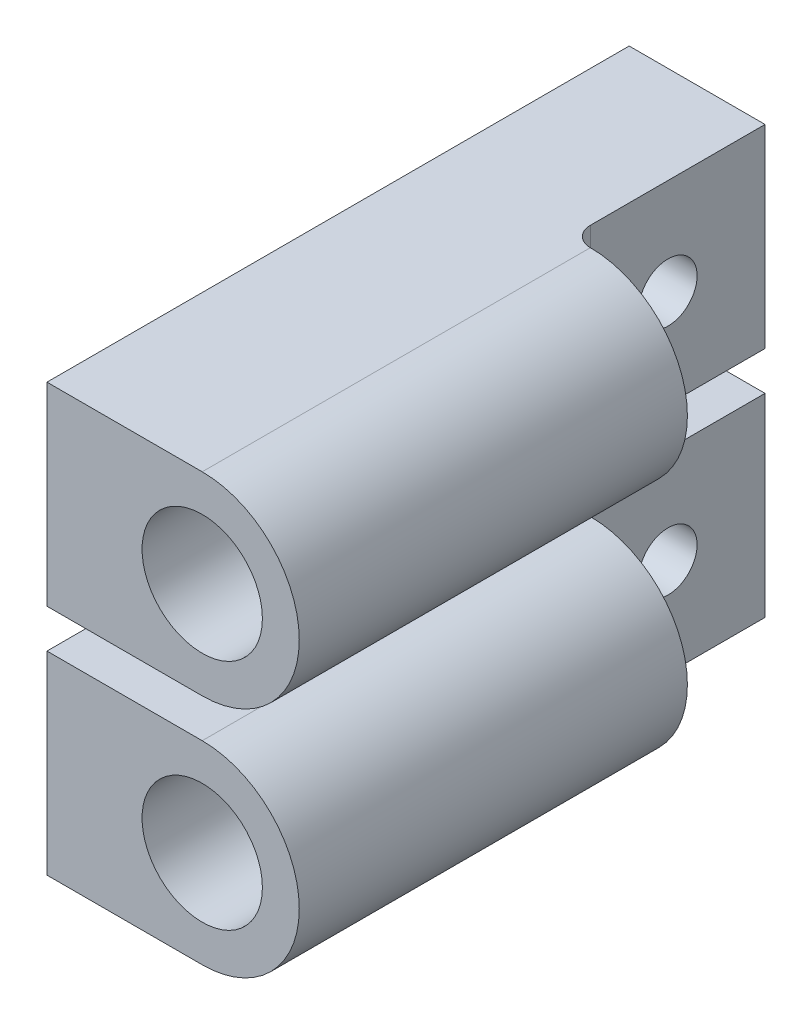
ISO-10303-21;
HEADER;
FILE_DESCRIPTION(('STEP AP214'),'2;1');
FILE_NAME('part.step','',(''),(''),'','','');
FILE_SCHEMA(('AUTOMOTIVE_DESIGN { 1 0 10303 214 1 1 1 1 }'));
ENDSEC;
DATA;
#1=APPLICATION_CONTEXT('core data for automotive mechanical design processes');
#2=APPLICATION_PROTOCOL_DEFINITION('international standard','automotive_design',2000,#1);
#3=PRODUCT_CONTEXT('',#1,'mechanical');
#4=PRODUCT('Part','Part','',(#3));
#5=PRODUCT_RELATED_PRODUCT_CATEGORY('part','',(#4));
#6=PRODUCT_DEFINITION_FORMATION('','',#4);
#7=PRODUCT_DEFINITION_CONTEXT('part definition',#1,'design');
#8=PRODUCT_DEFINITION('design','',#6,#7);
#9=PRODUCT_DEFINITION_SHAPE('','',#8);
#10=(LENGTH_UNIT() NAMED_UNIT(*) SI_UNIT(.MILLI.,.METRE.));
#11=(NAMED_UNIT(*) PLANE_ANGLE_UNIT() SI_UNIT($,.RADIAN.));
#12=(NAMED_UNIT(*) SI_UNIT($,.STERADIAN.) SOLID_ANGLE_UNIT());
#13=UNCERTAINTY_MEASURE_WITH_UNIT(LENGTH_MEASURE(1.E-05),#10,'distance_accuracy_value','');
#14=(GEOMETRIC_REPRESENTATION_CONTEXT(3) GLOBAL_UNCERTAINTY_ASSIGNED_CONTEXT((#13)) GLOBAL_UNIT_ASSIGNED_CONTEXT((#10,
#11,#12)) REPRESENTATION_CONTEXT('',''));
#15=CARTESIAN_POINT('',(0.,0.,0.));
#16=DIRECTION('',(0.,0.,1.));
#17=DIRECTION('',(1.,0.,0.));
#18=AXIS2_PLACEMENT_3D('',#15,#16,#17);
#19=CARTESIAN_POINT('',(-8.,17.,30.));
#20=DIRECTION('',(0.,-1.,0.));
#21=DIRECTION('',(0.,0.,-1.));
#22=AXIS2_PLACEMENT_3D('',#19,#20,#21);
#23=PLANE('',#22);
#24=DIRECTION('',(0.,0.,-1.));
#25=VECTOR('',#24,1.);
#26=CARTESIAN_POINT('',(0.,17.,30.));
#27=LINE('',#26,#25);
#28=CARTESIAN_POINT('',(0.,17.,30.));
#29=VERTEX_POINT('',#28);
#30=CARTESIAN_POINT('',(0.,17.,10.));
#31=VERTEX_POINT('',#30);
#32=EDGE_CURVE('E126',#29,#31,#27,.T.);
#33=ORIENTED_EDGE('',*,*,#32,.T.);
#34=CARTESIAN_POINT('',(0.,17.,9.));
#35=DIRECTION('',(0.,-1.,0.));
#36=DIRECTION('',(0.,0.,-1.));
#37=AXIS2_PLACEMENT_3D('',#34,#35,#36);
#38=CIRCLE('',#37,1.);
#39=CARTESIAN_POINT('',(-0.999999999999998,17.,9.));
#40=VERTEX_POINT('',#39);
#41=EDGE_CURVE('E12',#31,#40,#38,.T.);
#42=ORIENTED_EDGE('',*,*,#41,.T.);
#43=DIRECTION('',(0.,0.,1.));
#44=VECTOR('',#43,1.);
#45=CARTESIAN_POINT('',(-0.999999999999998,17.,10.));
#46=LINE('',#45,#44);
#47=CARTESIAN_POINT('',(-0.999999999999998,17.,0.));
#48=VERTEX_POINT('',#47);
#49=EDGE_CURVE('E98',#48,#40,#46,.T.);
#50=ORIENTED_EDGE('',*,*,#49,.F.);
#51=DIRECTION('',(-1.,0.,0.));
#52=VECTOR('',#51,1.);
#53=CARTESIAN_POINT('',(-8.,17.,0.));
#54=LINE('',#53,#52);
#55=CARTESIAN_POINT('',(-8.,17.,0.));
#56=VERTEX_POINT('',#55);
#57=EDGE_CURVE('E107',#48,#56,#54,.T.);
#58=ORIENTED_EDGE('',*,*,#57,.T.);
#59=DIRECTION('',(0.,0.,-1.));
#60=VECTOR('',#59,1.);
#61=CARTESIAN_POINT('',(-8.,17.,30.));
#62=LINE('',#61,#60);
#63=CARTESIAN_POINT('',(-8.,17.,30.));
#64=VERTEX_POINT('',#63);
#65=EDGE_CURVE('E134',#64,#56,#62,.T.);
#66=ORIENTED_EDGE('',*,*,#65,.F.);
#67=DIRECTION('',(-1.,0.,0.));
#68=VECTOR('',#67,1.);
#69=CARTESIAN_POINT('',(-8.,17.,30.));
#70=LINE('',#69,#68);
#71=EDGE_CURVE('E125',#29,#64,#70,.T.);
#72=ORIENTED_EDGE('',*,*,#71,.F.);
#73=EDGE_LOOP('',(#33,#42,#50,#58,#66,#72));
#74=FACE_BOUND('',#73,.T.);
#75=ADVANCED_FACE('F44',(#74),#23,.F.);
#76=CARTESIAN_POINT('',(-8.,7.,30.));
#77=DIRECTION('',(0.,1.,0.));
#78=DIRECTION('',(0.,0.,1.));
#79=AXIS2_PLACEMENT_3D('',#76,#77,#78);
#80=PLANE('',#79);
#81=DIRECTION('',(0.,0.,-1.));
#82=VECTOR('',#81,1.);
#83=CARTESIAN_POINT('',(-1.,7.,10.));
#84=LINE('',#83,#82);
#85=CARTESIAN_POINT('',(-1.,7.,9.));
#86=VERTEX_POINT('',#85);
#87=CARTESIAN_POINT('',(-0.999999999999999,7.,0.));
#88=VERTEX_POINT('',#87);
#89=EDGE_CURVE('E100',#86,#88,#84,.T.);
#90=ORIENTED_EDGE('',*,*,#89,.F.);
#91=CARTESIAN_POINT('',(0.,7.,9.));
#92=DIRECTION('',(0.,1.,0.));
#93=DIRECTION('',(0.,0.,1.));
#94=AXIS2_PLACEMENT_3D('',#91,#92,#93);
#95=CIRCLE('',#94,1.);
#96=CARTESIAN_POINT('',(0.,7.,10.));
#97=VERTEX_POINT('',#96);
#98=EDGE_CURVE('E52',#86,#97,#95,.T.);
#99=ORIENTED_EDGE('',*,*,#98,.T.);
#100=DIRECTION('',(0.,0.,-1.));
#101=VECTOR('',#100,1.);
#102=CARTESIAN_POINT('',(0.,7.,30.));
#103=LINE('',#102,#101);
#104=CARTESIAN_POINT('',(0.,7.,30.));
#105=VERTEX_POINT('',#104);
#106=EDGE_CURVE('E128',#105,#97,#103,.T.);
#107=ORIENTED_EDGE('',*,*,#106,.F.);
#108=DIRECTION('',(1.,0.,0.));
#109=VECTOR('',#108,1.);
#110=CARTESIAN_POINT('',(-8.,7.,30.));
#111=LINE('',#110,#109);
#112=CARTESIAN_POINT('',(-8.,7.,30.));
#113=VERTEX_POINT('',#112);
#114=EDGE_CURVE('E207',#113,#105,#111,.T.);
#115=ORIENTED_EDGE('',*,*,#114,.F.);
#116=DIRECTION('',(0.,0.,-1.));
#117=VECTOR('',#116,1.);
#118=CARTESIAN_POINT('',(-8.,7.,30.));
#119=LINE('',#118,#117);
#120=CARTESIAN_POINT('',(-8.,7.,0.));
#121=VERTEX_POINT('',#120);
#122=EDGE_CURVE('E131',#113,#121,#119,.T.);
#123=ORIENTED_EDGE('',*,*,#122,.T.);
#124=DIRECTION('',(1.,0.,0.));
#125=VECTOR('',#124,1.);
#126=CARTESIAN_POINT('',(-8.,7.,0.));
#127=LINE('',#126,#125);
#128=EDGE_CURVE('E116',#121,#88,#127,.T.);
#129=ORIENTED_EDGE('',*,*,#128,.T.);
#130=EDGE_LOOP('',(#90,#99,#107,#115,#123,#129));
#131=FACE_BOUND('',#130,.T.);
#132=ADVANCED_FACE('F144',(#131),#80,.F.);
#133=CARTESIAN_POINT('',(0.,12.,30.));
#134=DIRECTION('',(0.,0.,-1.));
#135=DIRECTION('',(-1.,0.,0.));
#136=AXIS2_PLACEMENT_3D('',#133,#134,#135);
#137=CYLINDRICAL_SURFACE('',#136,5.);
#138=CARTESIAN_POINT('',(0.,12.,10.));
#139=DIRECTION('',(0.,0.,-1.));
#140=DIRECTION('',(0.,1.,0.));
#141=AXIS2_PLACEMENT_3D('',#138,#139,#140);
#142=CIRCLE('',#141,5.);
#143=EDGE_CURVE('E136',#31,#97,#142,.T.);
#144=ORIENTED_EDGE('',*,*,#143,.F.);
#145=ORIENTED_EDGE('',*,*,#32,.F.);
#146=CARTESIAN_POINT('',(0.,12.,30.));
#147=DIRECTION('',(0.,0.,1.));
#148=DIRECTION('',(1.,0.,0.));
#149=AXIS2_PLACEMENT_3D('',#146,#147,#148);
#150=CIRCLE('',#149,5.);
#151=EDGE_CURVE('E121',#105,#29,#150,.T.);
#152=ORIENTED_EDGE('',*,*,#151,.F.);
#153=ORIENTED_EDGE('',*,*,#106,.T.);
#154=EDGE_LOOP('',(#144,#145,#152,#153));
#155=FACE_BOUND('',#154,.T.);
#156=ADVANCED_FACE('F152',(#155),#137,.T.);
#157=CARTESIAN_POINT('',(0.,12.,0.));
#158=DIRECTION('',(0.,0.,1.));
#159=DIRECTION('',(1.,0.,0.));
#160=AXIS2_PLACEMENT_3D('',#157,#158,#159);
#161=PLANE('',#160);
#162=DIRECTION('',(0.,1.,0.));
#163=VECTOR('',#162,1.);
#164=CARTESIAN_POINT('',(-0.999999999999998,17.,0.));
#165=LINE('',#164,#163);
#166=EDGE_CURVE('E96',#88,#48,#165,.T.);
#167=ORIENTED_EDGE('',*,*,#166,.F.);
#168=ORIENTED_EDGE('',*,*,#128,.F.);
#169=DIRECTION('',(0.,-1.,0.));
#170=VECTOR('',#169,1.);
#171=CARTESIAN_POINT('',(-8.,17.,0.));
#172=LINE('',#171,#170);
#173=EDGE_CURVE('E112',#56,#121,#172,.T.);
#174=ORIENTED_EDGE('',*,*,#173,.F.);
#175=ORIENTED_EDGE('',*,*,#57,.F.);
#176=EDGE_LOOP('',(#167,#168,#174,#175));
#177=FACE_BOUND('',#176,.T.);
#178=ADVANCED_FACE('F111',(#177),#161,.F.);
#179=CARTESIAN_POINT('',(-8.,17.,30.));
#180=DIRECTION('',(1.,0.,0.));
#181=DIRECTION('',(0.,1.,0.));
#182=AXIS2_PLACEMENT_3D('',#179,#180,#181);
#183=PLANE('',#182);
#184=CARTESIAN_POINT('',(-8.,12.,5.));
#185=DIRECTION('',(1.,0.,0.));
#186=DIRECTION('',(0.,0.,-1.));
#187=AXIS2_PLACEMENT_3D('',#184,#185,#186);
#188=CIRCLE('',#187,1.5);
#189=CARTESIAN_POINT('',(-8.,12.,3.5));
#190=VERTEX_POINT('',#189);
#191=EDGE_CURVE('E196',#190,#190,#188,.T.);
#192=ORIENTED_EDGE('',*,*,#191,.T.);
#193=EDGE_LOOP('',(#192));
#194=FACE_BOUND('',#193,.T.);
#195=ORIENTED_EDGE('',*,*,#173,.T.);
#196=ORIENTED_EDGE('',*,*,#122,.F.);
#197=DIRECTION('',(0.,-1.,0.));
#198=VECTOR('',#197,1.);
#199=CARTESIAN_POINT('',(-8.,17.,30.));
#200=LINE('',#199,#198);
#201=EDGE_CURVE('E206',#64,#113,#200,.T.);
#202=ORIENTED_EDGE('',*,*,#201,.F.);
#203=ORIENTED_EDGE('',*,*,#65,.T.);
#204=EDGE_LOOP('',(#195,#196,#202,#203));
#205=FACE_BOUND('',#204,.T.);
#206=ADVANCED_FACE('F166',(#194,#205),#183,.F.);
#207=CARTESIAN_POINT('',(0.,12.,30.));
#208=DIRECTION('',(0.,0.,1.));
#209=DIRECTION('',(1.,0.,0.));
#210=AXIS2_PLACEMENT_3D('',#207,#208,#209);
#211=PLANE('',#210);
#212=CARTESIAN_POINT('',(0.,12.,30.));
#213=DIRECTION('',(0.,0.,1.));
#214=DIRECTION('',(1.,0.,0.));
#215=AXIS2_PLACEMENT_3D('',#212,#213,#214);
#216=CIRCLE('',#215,3.1);
#217=CARTESIAN_POINT('',(3.1,12.,30.));
#218=VERTEX_POINT('',#217);
#219=EDGE_CURVE('E109',#218,#218,#216,.T.);
#220=ORIENTED_EDGE('',*,*,#219,.F.);
#221=EDGE_LOOP('',(#220));
#222=FACE_BOUND('',#221,.T.);
#223=ORIENTED_EDGE('',*,*,#71,.T.);
#224=ORIENTED_EDGE('',*,*,#201,.T.);
#225=ORIENTED_EDGE('',*,*,#114,.T.);
#226=ORIENTED_EDGE('',*,*,#151,.T.);
#227=EDGE_LOOP('',(#223,#224,#225,#226));
#228=FACE_BOUND('',#227,.T.);
#229=ADVANCED_FACE('F168',(#222,#228),#211,.T.);
#230=CARTESIAN_POINT('',(0.,12.,14.));
#231=DIRECTION('',(0.,0.,1.));
#232=DIRECTION('',(1.,0.,0.));
#233=AXIS2_PLACEMENT_3D('',#230,#231,#232);
#234=CYLINDRICAL_SURFACE('',#233,3.1);
#235=CARTESIAN_POINT('',(0.,12.,14.));
#236=DIRECTION('',(0.,0.,1.));
#237=DIRECTION('',(1.,0.,0.));
#238=AXIS2_PLACEMENT_3D('',#235,#236,#237);
#239=CIRCLE('',#238,3.1);
#240=CARTESIAN_POINT('',(3.1,12.,14.));
#241=VERTEX_POINT('',#240);
#242=EDGE_CURVE('E114',#241,#241,#239,.T.);
#243=ORIENTED_EDGE('',*,*,#242,.F.);
#244=EDGE_LOOP('',(#243));
#245=FACE_BOUND('',#244,.T.);
#246=ORIENTED_EDGE('',*,*,#219,.T.);
#247=EDGE_LOOP('',(#246));
#248=FACE_BOUND('',#247,.T.);
#249=ADVANCED_FACE('F177',(#245,#248),#234,.F.);
#250=CARTESIAN_POINT('',(0.,12.,14.));
#251=DIRECTION('',(0.,0.,1.));
#252=DIRECTION('',(1.,0.,0.));
#253=AXIS2_PLACEMENT_3D('',#250,#251,#252);
#254=PLANE('',#253);
#255=ORIENTED_EDGE('',*,*,#242,.T.);
#256=EDGE_LOOP('',(#255));
#257=FACE_BOUND('',#256,.T.);
#258=ADVANCED_FACE('F181',(#257),#254,.T.);
#259=CARTESIAN_POINT('',(5.,17.,10.));
#260=DIRECTION('',(0.,0.,-1.));
#261=DIRECTION('',(0.,1.,0.));
#262=AXIS2_PLACEMENT_3D('',#259,#260,#261);
#263=PLANE('',#262);
#264=ORIENTED_EDGE('',*,*,#143,.T.);
#265=DIRECTION('',(0.,-1.,0.));
#266=VECTOR('',#265,1.);
#267=CARTESIAN_POINT('',(0.,17.,10.));
#268=LINE('',#267,#266);
#269=EDGE_CURVE('E141',#97,#31,#268,.F.);
#270=ORIENTED_EDGE('',*,*,#269,.T.);
#271=EDGE_LOOP('',(#264,#270));
#272=FACE_BOUND('',#271,.T.);
#273=ADVANCED_FACE('F149',(#272),#263,.T.);
#274=CARTESIAN_POINT('',(-0.999999999999999,12.,0.));
#275=DIRECTION('',(1.,0.,0.));
#276=DIRECTION('',(0.,1.,0.));
#277=AXIS2_PLACEMENT_3D('',#274,#275,#276);
#278=PLANE('',#277);
#279=CARTESIAN_POINT('',(-0.999999999999999,12.,5.));
#280=DIRECTION('',(1.,0.,0.));
#281=DIRECTION('',(0.,0.,-1.));
#282=AXIS2_PLACEMENT_3D('',#279,#280,#281);
#283=CIRCLE('',#282,1.5);
#284=CARTESIAN_POINT('',(-0.999999999999999,12.,3.5));
#285=VERTEX_POINT('',#284);
#286=EDGE_CURVE('E194',#285,#285,#283,.T.);
#287=ORIENTED_EDGE('',*,*,#286,.F.);
#288=EDGE_LOOP('',(#287));
#289=FACE_BOUND('',#288,.T.);
#290=ORIENTED_EDGE('',*,*,#49,.T.);
#291=DIRECTION('',(0.,-1.,0.));
#292=VECTOR('',#291,1.);
#293=CARTESIAN_POINT('',(-1.,7.,9.));
#294=LINE('',#293,#292);
#295=EDGE_CURVE('E139',#40,#86,#294,.T.);
#296=ORIENTED_EDGE('',*,*,#295,.T.);
#297=ORIENTED_EDGE('',*,*,#89,.T.);
#298=ORIENTED_EDGE('',*,*,#166,.T.);
#299=EDGE_LOOP('',(#290,#296,#297,#298));
#300=FACE_BOUND('',#299,.T.);
#301=ADVANCED_FACE('F97',(#289,#300),#278,.T.);
#302=CARTESIAN_POINT('',(-8.,12.,5.));
#303=DIRECTION('',(1.,0.,0.));
#304=DIRECTION('',(0.,0.,-1.));
#305=AXIS2_PLACEMENT_3D('',#302,#303,#304);
#306=CYLINDRICAL_SURFACE('',#305,1.5);
#307=ORIENTED_EDGE('',*,*,#191,.F.);
#308=EDGE_LOOP('',(#307));
#309=FACE_BOUND('',#308,.T.);
#310=ORIENTED_EDGE('',*,*,#286,.T.);
#311=EDGE_LOOP('',(#310));
#312=FACE_BOUND('',#311,.T.);
#313=ADVANCED_FACE('F154',(#309,#312),#306,.F.);
#314=CARTESIAN_POINT('',(0.,12.,9.));
#315=DIRECTION('',(0.,1.,0.));
#316=DIRECTION('',(0.,0.,1.));
#317=AXIS2_PLACEMENT_3D('',#314,#315,#316);
#318=CYLINDRICAL_SURFACE('',#317,1.);
#319=ORIENTED_EDGE('',*,*,#41,.F.);
#320=ORIENTED_EDGE('',*,*,#269,.F.);
#321=ORIENTED_EDGE('',*,*,#98,.F.);
#322=ORIENTED_EDGE('',*,*,#295,.F.);
#323=EDGE_LOOP('',(#319,#320,#321,#322));
#324=FACE_BOUND('',#323,.T.);
#325=ADVANCED_FACE('F46',(#324),#318,.F.);
#326=CLOSED_SHELL('',(#75,#132,#156,#178,#206,#229,#249,#258,#273,#301,#313,#325));
#327=MANIFOLD_SOLID_BREP('B2',#326);
#328=CARTESIAN_POINT('',(-8.,5.,30.));
#329=DIRECTION('',(0.,-1.,0.));
#330=DIRECTION('',(0.,0.,-1.));
#331=AXIS2_PLACEMENT_3D('',#328,#329,#330);
#332=PLANE('',#331);
#333=DIRECTION('',(0.,0.,-1.));
#334=VECTOR('',#333,1.);
#335=CARTESIAN_POINT('',(0.,5.,30.));
#336=LINE('',#335,#334);
#337=CARTESIAN_POINT('',(0.,5.,30.));
#338=VERTEX_POINT('',#337);
#339=CARTESIAN_POINT('',(0.,5.,10.));
#340=VERTEX_POINT('',#339);
#341=EDGE_CURVE('E366',#338,#340,#336,.T.);
#342=ORIENTED_EDGE('',*,*,#341,.T.);
#343=CARTESIAN_POINT('',(0.,5.,9.));
#344=DIRECTION('',(0.,-1.,0.));
#345=DIRECTION('',(0.,0.,-1.));
#346=AXIS2_PLACEMENT_3D('',#343,#344,#345);
#347=CIRCLE('',#346,1.);
#348=CARTESIAN_POINT('',(-1.,5.,9.));
#349=VERTEX_POINT('',#348);
#350=EDGE_CURVE('E42',#340,#349,#347,.T.);
#351=ORIENTED_EDGE('',*,*,#350,.T.);
#352=DIRECTION('',(0.,0.,1.));
#353=VECTOR('',#352,1.);
#354=CARTESIAN_POINT('',(-1.,5.,10.));
#355=LINE('',#354,#353);
#356=CARTESIAN_POINT('',(-1.,5.,0.));
#357=VERTEX_POINT('',#356);
#358=EDGE_CURVE('E338',#357,#349,#355,.T.);
#359=ORIENTED_EDGE('',*,*,#358,.F.);
#360=DIRECTION('',(-1.,0.,0.));
#361=VECTOR('',#360,1.);
#362=CARTESIAN_POINT('',(-8.,5.,0.));
#363=LINE('',#362,#361);
#364=CARTESIAN_POINT('',(-8.,5.,0.));
#365=VERTEX_POINT('',#364);
#366=EDGE_CURVE('E347',#357,#365,#363,.T.);
#367=ORIENTED_EDGE('',*,*,#366,.T.);
#368=DIRECTION('',(0.,0.,-1.));
#369=VECTOR('',#368,1.);
#370=CARTESIAN_POINT('',(-8.,5.,30.));
#371=LINE('',#370,#369);
#372=CARTESIAN_POINT('',(-8.,5.,30.));
#373=VERTEX_POINT('',#372);
#374=EDGE_CURVE('E374',#373,#365,#371,.T.);
#375=ORIENTED_EDGE('',*,*,#374,.F.);
#376=DIRECTION('',(-1.,0.,0.));
#377=VECTOR('',#376,1.);
#378=CARTESIAN_POINT('',(-8.,5.,30.));
#379=LINE('',#378,#377);
#380=EDGE_CURVE('E365',#338,#373,#379,.T.);
#381=ORIENTED_EDGE('',*,*,#380,.F.);
#382=EDGE_LOOP('',(#342,#351,#359,#367,#375,#381));
#383=FACE_BOUND('',#382,.T.);
#384=ADVANCED_FACE('F284',(#383),#332,.F.);
#385=CARTESIAN_POINT('',(-8.,-5.,30.));
#386=DIRECTION('',(0.,1.,0.));
#387=DIRECTION('',(0.,0.,1.));
#388=AXIS2_PLACEMENT_3D('',#385,#386,#387);
#389=PLANE('',#388);
#390=DIRECTION('',(0.,0.,-1.));
#391=VECTOR('',#390,1.);
#392=CARTESIAN_POINT('',(-1.,-5.,10.));
#393=LINE('',#392,#391);
#394=CARTESIAN_POINT('',(-1.,-5.,9.));
#395=VERTEX_POINT('',#394);
#396=CARTESIAN_POINT('',(-1.,-5.,0.));
#397=VERTEX_POINT('',#396);
#398=EDGE_CURVE('E340',#395,#397,#393,.T.);
#399=ORIENTED_EDGE('',*,*,#398,.F.);
#400=CARTESIAN_POINT('',(0.,-5.,9.));
#401=DIRECTION('',(0.,1.,0.));
#402=DIRECTION('',(0.,0.,1.));
#403=AXIS2_PLACEMENT_3D('',#400,#401,#402);
#404=CIRCLE('',#403,1.);
#405=CARTESIAN_POINT('',(0.,-5.,10.));
#406=VERTEX_POINT('',#405);
#407=EDGE_CURVE('E292',#395,#406,#404,.T.);
#408=ORIENTED_EDGE('',*,*,#407,.T.);
#409=DIRECTION('',(0.,0.,-1.));
#410=VECTOR('',#409,1.);
#411=CARTESIAN_POINT('',(0.,-5.,30.));
#412=LINE('',#411,#410);
#413=CARTESIAN_POINT('',(0.,-5.,30.));
#414=VERTEX_POINT('',#413);
#415=EDGE_CURVE('E368',#414,#406,#412,.T.);
#416=ORIENTED_EDGE('',*,*,#415,.F.);
#417=DIRECTION('',(1.,0.,0.));
#418=VECTOR('',#417,1.);
#419=CARTESIAN_POINT('',(-8.,-5.,30.));
#420=LINE('',#419,#418);
#421=CARTESIAN_POINT('',(-8.,-5.,30.));
#422=VERTEX_POINT('',#421);
#423=EDGE_CURVE('E447',#422,#414,#420,.T.);
#424=ORIENTED_EDGE('',*,*,#423,.F.);
#425=DIRECTION('',(0.,0.,-1.));
#426=VECTOR('',#425,1.);
#427=CARTESIAN_POINT('',(-8.,-5.,30.));
#428=LINE('',#427,#426);
#429=CARTESIAN_POINT('',(-8.,-5.,0.));
#430=VERTEX_POINT('',#429);
#431=EDGE_CURVE('E371',#422,#430,#428,.T.);
#432=ORIENTED_EDGE('',*,*,#431,.T.);
#433=DIRECTION('',(1.,0.,0.));
#434=VECTOR('',#433,1.);
#435=CARTESIAN_POINT('',(-8.,-5.,0.));
#436=LINE('',#435,#434);
#437=EDGE_CURVE('E356',#430,#397,#436,.T.);
#438=ORIENTED_EDGE('',*,*,#437,.T.);
#439=EDGE_LOOP('',(#399,#408,#416,#424,#432,#438));
#440=FACE_BOUND('',#439,.T.);
#441=ADVANCED_FACE('F384',(#440),#389,.F.);
#442=CARTESIAN_POINT('',(0.,0.,30.));
#443=DIRECTION('',(0.,0.,-1.));
#444=DIRECTION('',(-1.,0.,0.));
#445=AXIS2_PLACEMENT_3D('',#442,#443,#444);
#446=CYLINDRICAL_SURFACE('',#445,5.);
#447=CARTESIAN_POINT('',(0.,0.,10.));
#448=DIRECTION('',(0.,0.,-1.));
#449=DIRECTION('',(0.,1.,0.));
#450=AXIS2_PLACEMENT_3D('',#447,#448,#449);
#451=CIRCLE('',#450,5.);
#452=EDGE_CURVE('E376',#340,#406,#451,.T.);
#453=ORIENTED_EDGE('',*,*,#452,.F.);
#454=ORIENTED_EDGE('',*,*,#341,.F.);
#455=CARTESIAN_POINT('',(0.,0.,30.));
#456=DIRECTION('',(0.,0.,1.));
#457=DIRECTION('',(1.,0.,0.));
#458=AXIS2_PLACEMENT_3D('',#455,#456,#457);
#459=CIRCLE('',#458,5.);
#460=EDGE_CURVE('E361',#414,#338,#459,.T.);
#461=ORIENTED_EDGE('',*,*,#460,.F.);
#462=ORIENTED_EDGE('',*,*,#415,.T.);
#463=EDGE_LOOP('',(#453,#454,#461,#462));
#464=FACE_BOUND('',#463,.T.);
#465=ADVANCED_FACE('F392',(#464),#446,.T.);
#466=CARTESIAN_POINT('',(0.,0.,0.));
#467=DIRECTION('',(0.,0.,1.));
#468=DIRECTION('',(1.,0.,0.));
#469=AXIS2_PLACEMENT_3D('',#466,#467,#468);
#470=PLANE('',#469);
#471=DIRECTION('',(0.,1.,0.));
#472=VECTOR('',#471,1.);
#473=CARTESIAN_POINT('',(-1.,5.,0.));
#474=LINE('',#473,#472);
#475=EDGE_CURVE('E336',#397,#357,#474,.T.);
#476=ORIENTED_EDGE('',*,*,#475,.F.);
#477=ORIENTED_EDGE('',*,*,#437,.F.);
#478=DIRECTION('',(0.,-1.,0.));
#479=VECTOR('',#478,1.);
#480=CARTESIAN_POINT('',(-8.,5.,0.));
#481=LINE('',#480,#479);
#482=EDGE_CURVE('E352',#365,#430,#481,.T.);
#483=ORIENTED_EDGE('',*,*,#482,.F.);
#484=ORIENTED_EDGE('',*,*,#366,.F.);
#485=EDGE_LOOP('',(#476,#477,#483,#484));
#486=FACE_BOUND('',#485,.T.);
#487=ADVANCED_FACE('F351',(#486),#470,.F.);
#488=CARTESIAN_POINT('',(-8.,5.,30.));
#489=DIRECTION('',(1.,0.,0.));
#490=DIRECTION('',(0.,1.,0.));
#491=AXIS2_PLACEMENT_3D('',#488,#489,#490);
#492=PLANE('',#491);
#493=CARTESIAN_POINT('',(-8.,0.,5.));
#494=DIRECTION('',(1.,0.,0.));
#495=DIRECTION('',(0.,0.,-1.));
#496=AXIS2_PLACEMENT_3D('',#493,#494,#495);
#497=CIRCLE('',#496,1.5);
#498=CARTESIAN_POINT('',(-8.,0.,3.5));
#499=VERTEX_POINT('',#498);
#500=EDGE_CURVE('E436',#499,#499,#497,.T.);
#501=ORIENTED_EDGE('',*,*,#500,.T.);
#502=EDGE_LOOP('',(#501));
#503=FACE_BOUND('',#502,.T.);
#504=ORIENTED_EDGE('',*,*,#482,.T.);
#505=ORIENTED_EDGE('',*,*,#431,.F.);
#506=DIRECTION('',(0.,-1.,0.));
#507=VECTOR('',#506,1.);
#508=CARTESIAN_POINT('',(-8.,5.,30.));
#509=LINE('',#508,#507);
#510=EDGE_CURVE('E446',#373,#422,#509,.T.);
#511=ORIENTED_EDGE('',*,*,#510,.F.);
#512=ORIENTED_EDGE('',*,*,#374,.T.);
#513=EDGE_LOOP('',(#504,#505,#511,#512));
#514=FACE_BOUND('',#513,.T.);
#515=ADVANCED_FACE('F406',(#503,#514),#492,.F.);
#516=CARTESIAN_POINT('',(0.,0.,30.));
#517=DIRECTION('',(0.,0.,1.));
#518=DIRECTION('',(1.,0.,0.));
#519=AXIS2_PLACEMENT_3D('',#516,#517,#518);
#520=PLANE('',#519);
#521=CARTESIAN_POINT('',(0.,0.,30.));
#522=DIRECTION('',(0.,0.,1.));
#523=DIRECTION('',(1.,0.,0.));
#524=AXIS2_PLACEMENT_3D('',#521,#522,#523);
#525=CIRCLE('',#524,3.1);
#526=CARTESIAN_POINT('',(3.1,0.,30.));
#527=VERTEX_POINT('',#526);
#528=EDGE_CURVE('E349',#527,#527,#525,.T.);
#529=ORIENTED_EDGE('',*,*,#528,.F.);
#530=EDGE_LOOP('',(#529));
#531=FACE_BOUND('',#530,.T.);
#532=ORIENTED_EDGE('',*,*,#380,.T.);
#533=ORIENTED_EDGE('',*,*,#510,.T.);
#534=ORIENTED_EDGE('',*,*,#423,.T.);
#535=ORIENTED_EDGE('',*,*,#460,.T.);
#536=EDGE_LOOP('',(#532,#533,#534,#535));
#537=FACE_BOUND('',#536,.T.);
#538=ADVANCED_FACE('F408',(#531,#537),#520,.T.);
#539=CARTESIAN_POINT('',(0.,0.,14.));
#540=DIRECTION('',(0.,0.,1.));
#541=DIRECTION('',(1.,0.,0.));
#542=AXIS2_PLACEMENT_3D('',#539,#540,#541);
#543=CYLINDRICAL_SURFACE('',#542,3.1);
#544=CARTESIAN_POINT('',(0.,0.,14.));
#545=DIRECTION('',(0.,0.,1.));
#546=DIRECTION('',(1.,0.,0.));
#547=AXIS2_PLACEMENT_3D('',#544,#545,#546);
#548=CIRCLE('',#547,3.1);
#549=CARTESIAN_POINT('',(3.1,0.,14.));
#550=VERTEX_POINT('',#549);
#551=EDGE_CURVE('E354',#550,#550,#548,.T.);
#552=ORIENTED_EDGE('',*,*,#551,.F.);
#553=EDGE_LOOP('',(#552));
#554=FACE_BOUND('',#553,.T.);
#555=ORIENTED_EDGE('',*,*,#528,.T.);
#556=EDGE_LOOP('',(#555));
#557=FACE_BOUND('',#556,.T.);
#558=ADVANCED_FACE('F417',(#554,#557),#543,.F.);
#559=CARTESIAN_POINT('',(0.,0.,14.));
#560=DIRECTION('',(0.,0.,1.));
#561=DIRECTION('',(1.,0.,0.));
#562=AXIS2_PLACEMENT_3D('',#559,#560,#561);
#563=PLANE('',#562);
#564=ORIENTED_EDGE('',*,*,#551,.T.);
#565=EDGE_LOOP('',(#564));
#566=FACE_BOUND('',#565,.T.);
#567=ADVANCED_FACE('F421',(#566),#563,.T.);
#568=CARTESIAN_POINT('',(5.,5.,10.));
#569=DIRECTION('',(0.,0.,-1.));
#570=DIRECTION('',(0.,1.,0.));
#571=AXIS2_PLACEMENT_3D('',#568,#569,#570);
#572=PLANE('',#571);
#573=ORIENTED_EDGE('',*,*,#452,.T.);
#574=DIRECTION('',(0.,-1.,0.));
#575=VECTOR('',#574,1.);
#576=CARTESIAN_POINT('',(0.,5.,10.));
#577=LINE('',#576,#575);
#578=EDGE_CURVE('E381',#406,#340,#577,.F.);
#579=ORIENTED_EDGE('',*,*,#578,.T.);
#580=EDGE_LOOP('',(#573,#579));
#581=FACE_BOUND('',#580,.T.);
#582=ADVANCED_FACE('F389',(#581),#572,.T.);
#583=CARTESIAN_POINT('',(-1.,0.,0.));
#584=DIRECTION('',(1.,0.,0.));
#585=DIRECTION('',(0.,1.,0.));
#586=AXIS2_PLACEMENT_3D('',#583,#584,#585);
#587=PLANE('',#586);
#588=CARTESIAN_POINT('',(-1.,0.,5.));
#589=DIRECTION('',(1.,0.,0.));
#590=DIRECTION('',(0.,0.,-1.));
#591=AXIS2_PLACEMENT_3D('',#588,#589,#590);
#592=CIRCLE('',#591,1.5);
#593=CARTESIAN_POINT('',(-1.,0.,3.5));
#594=VERTEX_POINT('',#593);
#595=EDGE_CURVE('E434',#594,#594,#592,.T.);
#596=ORIENTED_EDGE('',*,*,#595,.F.);
#597=EDGE_LOOP('',(#596));
#598=FACE_BOUND('',#597,.T.);
#599=ORIENTED_EDGE('',*,*,#358,.T.);
#600=DIRECTION('',(0.,-1.,0.));
#601=VECTOR('',#600,1.);
#602=CARTESIAN_POINT('',(-1.,-5.,9.));
#603=LINE('',#602,#601);
#604=EDGE_CURVE('E379',#349,#395,#603,.T.);
#605=ORIENTED_EDGE('',*,*,#604,.T.);
#606=ORIENTED_EDGE('',*,*,#398,.T.);
#607=ORIENTED_EDGE('',*,*,#475,.T.);
#608=EDGE_LOOP('',(#599,#605,#606,#607));
#609=FACE_BOUND('',#608,.T.);
#610=ADVANCED_FACE('F337',(#598,#609),#587,.T.);
#611=CARTESIAN_POINT('',(-8.,0.,5.));
#612=DIRECTION('',(1.,0.,0.));
#613=DIRECTION('',(0.,0.,-1.));
#614=AXIS2_PLACEMENT_3D('',#611,#612,#613);
#615=CYLINDRICAL_SURFACE('',#614,1.5);
#616=ORIENTED_EDGE('',*,*,#500,.F.);
#617=EDGE_LOOP('',(#616));
#618=FACE_BOUND('',#617,.T.);
#619=ORIENTED_EDGE('',*,*,#595,.T.);
#620=EDGE_LOOP('',(#619));
#621=FACE_BOUND('',#620,.T.);
#622=ADVANCED_FACE('F394',(#618,#621),#615,.F.);
#623=CARTESIAN_POINT('',(0.,0.,9.));
#624=DIRECTION('',(0.,1.,0.));
#625=DIRECTION('',(0.,0.,1.));
#626=AXIS2_PLACEMENT_3D('',#623,#624,#625);
#627=CYLINDRICAL_SURFACE('',#626,1.);
#628=ORIENTED_EDGE('',*,*,#350,.F.);
#629=ORIENTED_EDGE('',*,*,#578,.F.);
#630=ORIENTED_EDGE('',*,*,#407,.F.);
#631=ORIENTED_EDGE('',*,*,#604,.F.);
#632=EDGE_LOOP('',(#628,#629,#630,#631));
#633=FACE_BOUND('',#632,.T.);
#634=ADVANCED_FACE('F286',(#633),#627,.F.);
#635=CLOSED_SHELL('',(#384,#441,#465,#487,#515,#538,#558,#567,#582,#610,#622,#634));
#636=MANIFOLD_SOLID_BREP('B6',#635);
#637=ADVANCED_BREP_SHAPE_REPRESENTATION('',(#18,#327,#636),#14);
#638=SHAPE_DEFINITION_REPRESENTATION(#9,#637);
ENDSEC;
END-ISO-10303-21;
